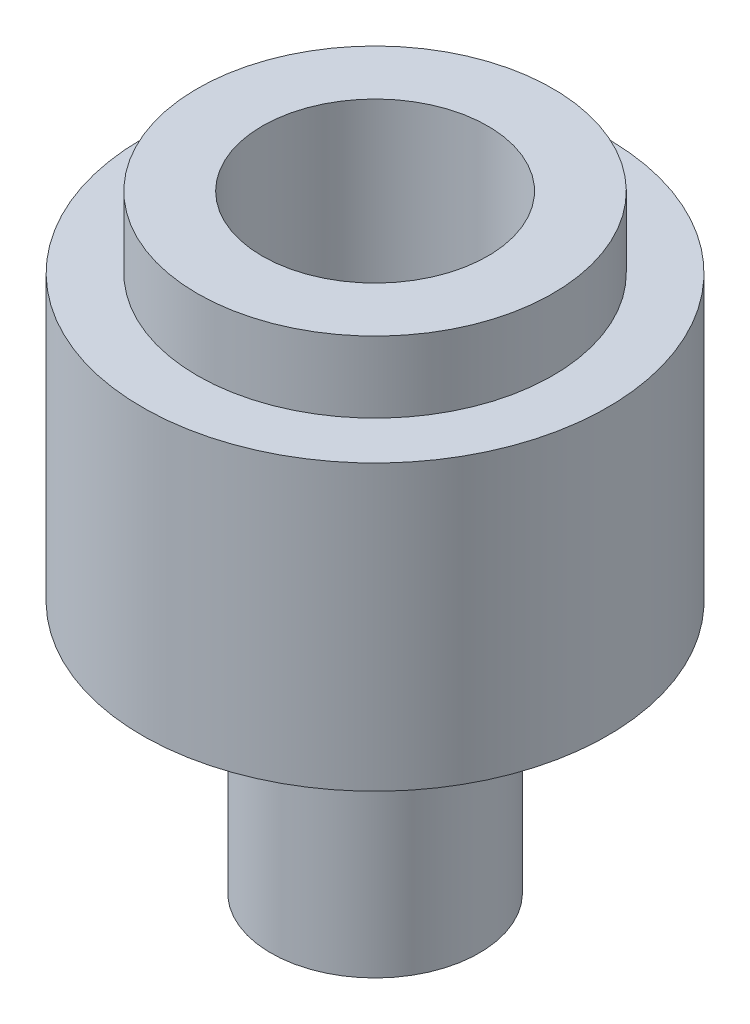
ISO-10303-21;
HEADER;
FILE_DESCRIPTION(('STEP AP214'),'2;1');
FILE_NAME('part.step','',(''),(''),'','','');
FILE_SCHEMA(('AUTOMOTIVE_DESIGN { 1 0 10303 214 1 1 1 1 }'));
ENDSEC;
DATA;
#1=APPLICATION_CONTEXT('core data for automotive mechanical design processes');
#2=APPLICATION_PROTOCOL_DEFINITION('international standard','automotive_design',2000,#1);
#3=PRODUCT_CONTEXT('',#1,'mechanical');
#4=PRODUCT('Part','Part','',(#3));
#5=PRODUCT_RELATED_PRODUCT_CATEGORY('part','',(#4));
#6=PRODUCT_DEFINITION_FORMATION('','',#4);
#7=PRODUCT_DEFINITION_CONTEXT('part definition',#1,'design');
#8=PRODUCT_DEFINITION('design','',#6,#7);
#9=PRODUCT_DEFINITION_SHAPE('','',#8);
#10=(LENGTH_UNIT() NAMED_UNIT(*) SI_UNIT(.MILLI.,.METRE.));
#11=(NAMED_UNIT(*) PLANE_ANGLE_UNIT() SI_UNIT($,.RADIAN.));
#12=(NAMED_UNIT(*) SI_UNIT($,.STERADIAN.) SOLID_ANGLE_UNIT());
#13=UNCERTAINTY_MEASURE_WITH_UNIT(LENGTH_MEASURE(1.E-05),#10,'distance_accuracy_value','');
#14=(GEOMETRIC_REPRESENTATION_CONTEXT(3) GLOBAL_UNCERTAINTY_ASSIGNED_CONTEXT((#13)) GLOBAL_UNIT_ASSIGNED_CONTEXT((#10,
#11,#12)) REPRESENTATION_CONTEXT('',''));
#15=CARTESIAN_POINT('',(0.,0.,0.));
#16=DIRECTION('',(0.,0.,1.));
#17=DIRECTION('',(1.,0.,0.));
#18=AXIS2_PLACEMENT_3D('',#15,#16,#17);
#19=CARTESIAN_POINT('',(0.,6.64674675818642,0.));
#20=DIRECTION('',(0.,1.,0.));
#21=DIRECTION('',(-1.,0.,0.));
#22=AXIS2_PLACEMENT_3D('',#19,#20,#21);
#23=CYLINDRICAL_SURFACE('',#22,2.2);
#24=CARTESIAN_POINT('',(0.,5.03538077049612,0.));
#25=DIRECTION('',(0.,1.,0.));
#26=DIRECTION('',(-1.,0.,0.));
#27=AXIS2_PLACEMENT_3D('',#24,#25,#26);
#28=CIRCLE('',#27,2.2);
#29=CARTESIAN_POINT('',(-2.2,5.03538077049612,0.));
#30=VERTEX_POINT('',#29);
#31=EDGE_CURVE('E44',#30,#30,#28,.T.);
#32=ORIENTED_EDGE('',*,*,#31,.F.);
#33=EDGE_LOOP('',(#32));
#34=FACE_BOUND('',#33,.T.);
#35=CARTESIAN_POINT('',(0.,1.27017059221717,0.));
#36=DIRECTION('',(0.,1.,0.));
#37=DIRECTION('',(-1.,0.,0.));
#38=AXIS2_PLACEMENT_3D('',#35,#36,#37);
#39=CIRCLE('',#38,2.2);
#40=CARTESIAN_POINT('',(-2.2,1.27017059221717,0.));
#41=VERTEX_POINT('',#40);
#42=EDGE_CURVE('E68',#41,#41,#39,.T.);
#43=ORIENTED_EDGE('',*,*,#42,.T.);
#44=EDGE_LOOP('',(#43));
#45=FACE_BOUND('',#44,.T.);
#46=ADVANCED_FACE('F41',(#34,#45),#23,.T.);
#47=CARTESIAN_POINT('',(0.,5.03538077049612,0.));
#48=DIRECTION('',(0.,1.,0.));
#49=DIRECTION('',(-1.,0.,0.));
#50=AXIS2_PLACEMENT_3D('',#47,#48,#49);
#51=CONICAL_SURFACE('',#50,2.2,1.0471975511966);
#52=CARTESIAN_POINT('',(0.,6.6,0.));
#53=DIRECTION('',(0.,1.,0.));
#54=DIRECTION('',(-1.,0.,0.));
#55=AXIS2_PLACEMENT_3D('',#52,#53,#54);
#56=CIRCLE('',#55,4.91);
#57=CARTESIAN_POINT('',(-4.91,6.6,0.));
#58=VERTEX_POINT('',#57);
#59=EDGE_CURVE('E74',#58,#58,#56,.T.);
#60=ORIENTED_EDGE('',*,*,#59,.F.);
#61=EDGE_LOOP('',(#60));
#62=FACE_BOUND('',#61,.T.);
#63=ORIENTED_EDGE('',*,*,#31,.T.);
#64=EDGE_LOOP('',(#63));
#65=FACE_BOUND('',#64,.T.);
#66=ADVANCED_FACE('F89',(#62,#65),#51,.T.);
#67=CARTESIAN_POINT('',(0.,6.64674675818642,0.));
#68=DIRECTION('',(0.,1.,0.));
#69=DIRECTION('',(-1.,0.,0.));
#70=AXIS2_PLACEMENT_3D('',#67,#68,#69);
#71=CYLINDRICAL_SURFACE('',#70,4.91);
#72=CARTESIAN_POINT('',(0.,12.6,0.));
#73=DIRECTION('',(0.,1.,0.));
#74=DIRECTION('',(-1.,0.,0.));
#75=AXIS2_PLACEMENT_3D('',#72,#73,#74);
#76=CIRCLE('',#75,4.91);
#77=CARTESIAN_POINT('',(-4.91,12.6,0.));
#78=VERTEX_POINT('',#77);
#79=EDGE_CURVE('E67',#78,#78,#76,.T.);
#80=ORIENTED_EDGE('',*,*,#79,.F.);
#81=EDGE_LOOP('',(#80));
#82=FACE_BOUND('',#81,.T.);
#83=ORIENTED_EDGE('',*,*,#59,.T.);
#84=EDGE_LOOP('',(#83));
#85=FACE_BOUND('',#84,.T.);
#86=ADVANCED_FACE('F106',(#82,#85),#71,.T.);
#87=CARTESIAN_POINT('',(4.91,12.6,0.));
#88=DIRECTION('',(0.,-1.,0.));
#89=DIRECTION('',(1.,0.,0.));
#90=AXIS2_PLACEMENT_3D('',#87,#88,#89);
#91=PLANE('',#90);
#92=CARTESIAN_POINT('',(0.,12.6,0.));
#93=DIRECTION('',(0.,1.,0.));
#94=DIRECTION('',(0.,0.,1.));
#95=AXIS2_PLACEMENT_3D('',#92,#93,#94);
#96=CIRCLE('',#95,3.75);
#97=CARTESIAN_POINT('',(0.,12.6,3.75));
#98=VERTEX_POINT('',#97);
#99=EDGE_CURVE('E11',#98,#98,#96,.T.);
#100=ORIENTED_EDGE('',*,*,#99,.F.);
#101=EDGE_LOOP('',(#100));
#102=FACE_BOUND('',#101,.T.);
#103=ORIENTED_EDGE('',*,*,#79,.T.);
#104=EDGE_LOOP('',(#103));
#105=FACE_BOUND('',#104,.T.);
#106=ADVANCED_FACE('F98',(#102,#105),#91,.F.);
#107=CARTESIAN_POINT('',(0.,0.,0.));
#108=DIRECTION('',(0.,1.,0.));
#109=DIRECTION('',(-1.,0.,0.));
#110=AXIS2_PLACEMENT_3D('',#107,#108,#109);
#111=CONICAL_SURFACE('',#110,0.,1.0471975511966);
#112=ORIENTED_EDGE('',*,*,#42,.F.);
#113=EDGE_LOOP('',(#112));
#114=FACE_BOUND('',#113,.T.);
#115=CARTESIAN_POINT('',(0.,0.,0.));
#116=VERTEX_POINT('',#115);
#117=VERTEX_LOOP('',#116);
#118=FACE_BOUND('',#117,.T.);
#119=ADVANCED_FACE('F95',(#114,#118),#111,.T.);
#120=CARTESIAN_POINT('',(0.,14.1,0.));
#121=DIRECTION('',(0.,1.,0.));
#122=DIRECTION('',(0.,0.,1.));
#123=AXIS2_PLACEMENT_3D('',#120,#121,#122);
#124=PLANE('',#123);
#125=CARTESIAN_POINT('',(0.,14.1,0.));
#126=DIRECTION('',(0.,1.,0.));
#127=DIRECTION('',(0.,0.,1.));
#128=AXIS2_PLACEMENT_3D('',#125,#126,#127);
#129=CIRCLE('',#128,3.75);
#130=CARTESIAN_POINT('',(0.,14.1,3.75));
#131=VERTEX_POINT('',#130);
#132=EDGE_CURVE('E77',#131,#131,#129,.T.);
#133=ORIENTED_EDGE('',*,*,#132,.T.);
#134=EDGE_LOOP('',(#133));
#135=FACE_BOUND('',#134,.T.);
#136=CARTESIAN_POINT('',(0.,14.1,0.));
#137=DIRECTION('',(0.,1.,0.));
#138=DIRECTION('',(0.,0.,1.));
#139=AXIS2_PLACEMENT_3D('',#136,#137,#138);
#140=CIRCLE('',#139,2.38);
#141=CARTESIAN_POINT('',(0.,14.1,2.38));
#142=VERTEX_POINT('',#141);
#143=EDGE_CURVE('E169',#142,#142,#140,.T.);
#144=ORIENTED_EDGE('',*,*,#143,.F.);
#145=EDGE_LOOP('',(#144));
#146=FACE_BOUND('',#145,.T.);
#147=ADVANCED_FACE('F97',(#135,#146),#124,.T.);
#148=CARTESIAN_POINT('',(0.,14.1,0.));
#149=DIRECTION('',(0.,-1.,0.));
#150=DIRECTION('',(0.,0.,-1.));
#151=AXIS2_PLACEMENT_3D('',#148,#149,#150);
#152=CYLINDRICAL_SURFACE('',#151,3.75);
#153=ORIENTED_EDGE('',*,*,#132,.F.);
#154=EDGE_LOOP('',(#153));
#155=FACE_BOUND('',#154,.T.);
#156=ORIENTED_EDGE('',*,*,#99,.T.);
#157=EDGE_LOOP('',(#156));
#158=FACE_BOUND('',#157,.T.);
#159=ADVANCED_FACE('F60',(#155,#158),#152,.T.);
#160=CARTESIAN_POINT('',(0.,8.076795031472,0.));
#161=DIRECTION('',(0.,1.,0.));
#162=DIRECTION('',(-1.,0.,0.));
#163=AXIS2_PLACEMENT_3D('',#160,#161,#162);
#164=CONICAL_SURFACE('',#163,2.38,1.02974425867666);
#165=CARTESIAN_POINT('',(0.,6.64674675818642,0.));
#166=VERTEX_POINT('',#165);
#167=VERTEX_LOOP('',#166);
#168=FACE_BOUND('',#167,.T.);
#169=CARTESIAN_POINT('',(0.,8.076795031472,0.));
#170=DIRECTION('',(0.,1.,0.));
#171=DIRECTION('',(-1.,0.,0.));
#172=AXIS2_PLACEMENT_3D('',#169,#170,#171);
#173=CIRCLE('',#172,2.38);
#174=CARTESIAN_POINT('',(-2.38,8.076795031472,0.));
#175=VERTEX_POINT('',#174);
#176=EDGE_CURVE('E64',#175,#175,#173,.T.);
#177=ORIENTED_EDGE('',*,*,#176,.T.);
#178=EDGE_LOOP('',(#177));
#179=FACE_BOUND('',#178,.T.);
#180=ADVANCED_FACE('F56',(#168,#179),#164,.F.);
#181=CARTESIAN_POINT('',(0.,6.64674675818642,0.));
#182=DIRECTION('',(0.,1.,0.));
#183=DIRECTION('',(-1.,0.,0.));
#184=AXIS2_PLACEMENT_3D('',#181,#182,#183);
#185=CYLINDRICAL_SURFACE('',#184,2.38);
#186=ORIENTED_EDGE('',*,*,#176,.F.);
#187=EDGE_LOOP('',(#186));
#188=FACE_BOUND('',#187,.T.);
#189=ORIENTED_EDGE('',*,*,#143,.T.);
#190=EDGE_LOOP('',(#189));
#191=FACE_BOUND('',#190,.T.);
#192=ADVANCED_FACE('F59',(#188,#191),#185,.F.);
#193=CLOSED_SHELL('',(#46,#66,#86,#106,#119,#147,#159,#180,#192));
#194=MANIFOLD_SOLID_BREP('B2',#193);
#195=ADVANCED_BREP_SHAPE_REPRESENTATION('',(#18,#194),#14);
#196=SHAPE_DEFINITION_REPRESENTATION(#9,#195);
ENDSEC;
END-ISO-10303-21;
